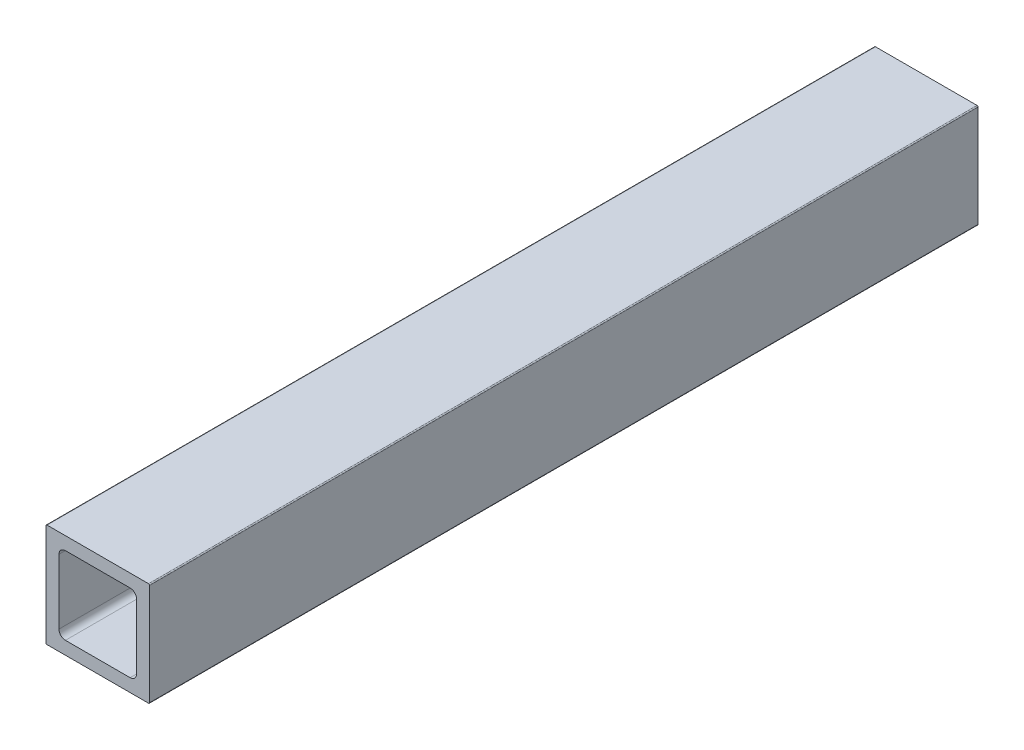
ISO-10303-21;
HEADER;
FILE_DESCRIPTION(('STEP AP214'),'2;1');
FILE_NAME('part.step','',(''),(''),'','','');
FILE_SCHEMA(('AUTOMOTIVE_DESIGN { 1 0 10303 214 1 1 1 1 }'));
ENDSEC;
DATA;
#1=APPLICATION_CONTEXT('core data for automotive mechanical design processes');
#2=APPLICATION_PROTOCOL_DEFINITION('international standard','automotive_design',2000,#1);
#3=PRODUCT_CONTEXT('',#1,'mechanical');
#4=PRODUCT('Part','Part','',(#3));
#5=PRODUCT_RELATED_PRODUCT_CATEGORY('part','',(#4));
#6=PRODUCT_DEFINITION_FORMATION('','',#4);
#7=PRODUCT_DEFINITION_CONTEXT('part definition',#1,'design');
#8=PRODUCT_DEFINITION('design','',#6,#7);
#9=PRODUCT_DEFINITION_SHAPE('','',#8);
#10=(LENGTH_UNIT() NAMED_UNIT(*) SI_UNIT(.MILLI.,.METRE.));
#11=(NAMED_UNIT(*) PLANE_ANGLE_UNIT() SI_UNIT($,.RADIAN.));
#12=(NAMED_UNIT(*) SI_UNIT($,.STERADIAN.) SOLID_ANGLE_UNIT());
#13=UNCERTAINTY_MEASURE_WITH_UNIT(LENGTH_MEASURE(1.E-05),#10,'distance_accuracy_value','');
#14=(GEOMETRIC_REPRESENTATION_CONTEXT(3) GLOBAL_UNCERTAINTY_ASSIGNED_CONTEXT((#13)) GLOBAL_UNIT_ASSIGNED_CONTEXT((#10,
#11,#12)) REPRESENTATION_CONTEXT('',''));
#15=CARTESIAN_POINT('',(0.,0.,0.));
#16=DIRECTION('',(0.,0.,1.));
#17=DIRECTION('',(1.,0.,0.));
#18=AXIS2_PLACEMENT_3D('',#15,#16,#17);
#19=CARTESIAN_POINT('',(3.175,4.7625,1828.8));
#20=DIRECTION('',(1.,0.,0.));
#21=DIRECTION('',(0.,1.,0.));
#22=AXIS2_PLACEMENT_3D('',#19,#20,#21);
#23=PLANE('',#22);
#24=DIRECTION('',(0.,-1.,0.));
#25=VECTOR('',#24,1.);
#26=CARTESIAN_POINT('',(3.175,4.7625,1625.6));
#27=LINE('',#26,#25);
#28=CARTESIAN_POINT('',(3.175,20.6375,1625.6));
#29=VERTEX_POINT('',#28);
#30=CARTESIAN_POINT('',(3.175,4.7625,1625.6));
#31=VERTEX_POINT('',#30);
#32=EDGE_CURVE('E58',#29,#31,#27,.T.);
#33=ORIENTED_EDGE('',*,*,#32,.F.);
#34=DIRECTION('',(0.,0.,-1.));
#35=VECTOR('',#34,1.);
#36=CARTESIAN_POINT('',(3.175,20.6375,1828.8));
#37=LINE('',#36,#35);
#38=CARTESIAN_POINT('',(3.175,20.6375,1828.8));
#39=VERTEX_POINT('',#38);
#40=EDGE_CURVE('E51',#39,#29,#37,.T.);
#41=ORIENTED_EDGE('',*,*,#40,.F.);
#42=DIRECTION('',(0.,-1.,0.));
#43=VECTOR('',#42,1.);
#44=CARTESIAN_POINT('',(3.175,4.7625,1828.8));
#45=LINE('',#44,#43);
#46=CARTESIAN_POINT('',(3.175,4.7625,1828.8));
#47=VERTEX_POINT('',#46);
#48=EDGE_CURVE('E218',#39,#47,#45,.T.);
#49=ORIENTED_EDGE('',*,*,#48,.T.);
#50=DIRECTION('',(0.,0.,-1.));
#51=VECTOR('',#50,1.);
#52=CARTESIAN_POINT('',(3.175,4.7625,1828.8));
#53=LINE('',#52,#51);
#54=EDGE_CURVE('E325',#47,#31,#53,.T.);
#55=ORIENTED_EDGE('',*,*,#54,.T.);
#56=EDGE_LOOP('',(#33,#41,#49,#55));
#57=FACE_BOUND('',#56,.T.);
#58=ADVANCED_FACE('F43',(#57),#23,.T.);
#59=CARTESIAN_POINT('',(4.7625,20.6375,1828.8));
#60=DIRECTION('',(0.,0.,-1.));
#61=DIRECTION('',(-1.,0.,0.));
#62=AXIS2_PLACEMENT_3D('',#59,#60,#61);
#63=CYLINDRICAL_SURFACE('',#62,1.5875);
#64=ORIENTED_EDGE('',*,*,#40,.T.);
#65=CARTESIAN_POINT('',(4.7625,20.6375,1625.6));
#66=DIRECTION('',(0.,0.,1.));
#67=DIRECTION('',(1.,0.,0.));
#68=AXIS2_PLACEMENT_3D('',#65,#66,#67);
#69=CIRCLE('',#68,1.5875);
#70=CARTESIAN_POINT('',(4.7625,22.225,1625.6));
#71=VERTEX_POINT('',#70);
#72=EDGE_CURVE('E304',#29,#71,#69,.F.);
#73=ORIENTED_EDGE('',*,*,#72,.T.);
#74=DIRECTION('',(0.,0.,-1.));
#75=VECTOR('',#74,1.);
#76=CARTESIAN_POINT('',(4.7625,22.225,1828.8));
#77=LINE('',#76,#75);
#78=CARTESIAN_POINT('',(4.7625,22.225,1828.8));
#79=VERTEX_POINT('',#78);
#80=EDGE_CURVE('E292',#79,#71,#77,.T.);
#81=ORIENTED_EDGE('',*,*,#80,.F.);
#82=CARTESIAN_POINT('',(4.7625,20.6375,1828.8));
#83=DIRECTION('',(0.,0.,1.));
#84=DIRECTION('',(-1.,0.,0.));
#85=AXIS2_PLACEMENT_3D('',#82,#83,#84);
#86=CIRCLE('',#85,1.5875);
#87=EDGE_CURVE('E223',#79,#39,#86,.T.);
#88=ORIENTED_EDGE('',*,*,#87,.T.);
#89=EDGE_LOOP('',(#64,#73,#81,#88));
#90=FACE_BOUND('',#89,.T.);
#91=ADVANCED_FACE('F302',(#90),#63,.F.);
#92=CARTESIAN_POINT('',(4.7625,22.225,1828.8));
#93=DIRECTION('',(0.,-1.,0.));
#94=DIRECTION('',(0.,0.,-1.));
#95=AXIS2_PLACEMENT_3D('',#92,#93,#94);
#96=PLANE('',#95);
#97=DIRECTION('',(-1.,0.,0.));
#98=VECTOR('',#97,1.);
#99=CARTESIAN_POINT('',(4.7625,22.225,1625.6));
#100=LINE('',#99,#98);
#101=CARTESIAN_POINT('',(20.6375,22.225,1625.6));
#102=VERTEX_POINT('',#101);
#103=EDGE_CURVE('E340',#102,#71,#100,.T.);
#104=ORIENTED_EDGE('',*,*,#103,.F.);
#105=DIRECTION('',(0.,0.,-1.));
#106=VECTOR('',#105,1.);
#107=CARTESIAN_POINT('',(20.6375,22.225,1828.8));
#108=LINE('',#107,#106);
#109=CARTESIAN_POINT('',(20.6375,22.225,1828.8));
#110=VERTEX_POINT('',#109);
#111=EDGE_CURVE('E238',#110,#102,#108,.T.);
#112=ORIENTED_EDGE('',*,*,#111,.F.);
#113=DIRECTION('',(-1.,0.,0.));
#114=VECTOR('',#113,1.);
#115=CARTESIAN_POINT('',(4.7625,22.225,1828.8));
#116=LINE('',#115,#114);
#117=EDGE_CURVE('E227',#110,#79,#116,.T.);
#118=ORIENTED_EDGE('',*,*,#117,.T.);
#119=ORIENTED_EDGE('',*,*,#80,.T.);
#120=EDGE_LOOP('',(#104,#112,#118,#119));
#121=FACE_BOUND('',#120,.T.);
#122=ADVANCED_FACE('F291',(#121),#96,.T.);
#123=CARTESIAN_POINT('',(20.6375,20.6375,1828.8));
#124=DIRECTION('',(0.,0.,-1.));
#125=DIRECTION('',(-1.,0.,0.));
#126=AXIS2_PLACEMENT_3D('',#123,#124,#125);
#127=CYLINDRICAL_SURFACE('',#126,1.5875);
#128=ORIENTED_EDGE('',*,*,#111,.T.);
#129=CARTESIAN_POINT('',(20.6375,20.6375,1625.6));
#130=DIRECTION('',(0.,0.,1.));
#131=DIRECTION('',(1.,0.,0.));
#132=AXIS2_PLACEMENT_3D('',#129,#130,#131);
#133=CIRCLE('',#132,1.5875);
#134=CARTESIAN_POINT('',(22.225,20.6375,1625.6));
#135=VERTEX_POINT('',#134);
#136=EDGE_CURVE('E342',#102,#135,#133,.F.);
#137=ORIENTED_EDGE('',*,*,#136,.T.);
#138=DIRECTION('',(0.,0.,-1.));
#139=VECTOR('',#138,1.);
#140=CARTESIAN_POINT('',(22.225,20.6375,1828.8));
#141=LINE('',#140,#139);
#142=CARTESIAN_POINT('',(22.225,20.6375,1828.8));
#143=VERTEX_POINT('',#142);
#144=EDGE_CURVE('E234',#143,#135,#141,.T.);
#145=ORIENTED_EDGE('',*,*,#144,.F.);
#146=CARTESIAN_POINT('',(20.6375,20.6375,1828.8));
#147=DIRECTION('',(0.,0.,1.));
#148=DIRECTION('',(-1.,0.,0.));
#149=AXIS2_PLACEMENT_3D('',#146,#147,#148);
#150=CIRCLE('',#149,1.5875);
#151=EDGE_CURVE('E213',#143,#110,#150,.T.);
#152=ORIENTED_EDGE('',*,*,#151,.T.);
#153=EDGE_LOOP('',(#128,#137,#145,#152));
#154=FACE_BOUND('',#153,.T.);
#155=ADVANCED_FACE('F500',(#154),#127,.F.);
#156=CARTESIAN_POINT('',(22.225,4.7625,1828.8));
#157=DIRECTION('',(-1.,0.,0.));
#158=DIRECTION('',(0.,0.,1.));
#159=AXIS2_PLACEMENT_3D('',#156,#157,#158);
#160=PLANE('',#159);
#161=DIRECTION('',(0.,1.,0.));
#162=VECTOR('',#161,1.);
#163=CARTESIAN_POINT('',(22.225,4.7625,1625.6));
#164=LINE('',#163,#162);
#165=CARTESIAN_POINT('',(22.225,4.7625,1625.6));
#166=VERTEX_POINT('',#165);
#167=EDGE_CURVE('E345',#166,#135,#164,.T.);
#168=ORIENTED_EDGE('',*,*,#167,.F.);
#169=DIRECTION('',(0.,0.,-1.));
#170=VECTOR('',#169,1.);
#171=CARTESIAN_POINT('',(22.225,4.7625,1828.8));
#172=LINE('',#171,#170);
#173=CARTESIAN_POINT('',(22.225,4.7625,1828.8));
#174=VERTEX_POINT('',#173);
#175=EDGE_CURVE('E239',#174,#166,#172,.T.);
#176=ORIENTED_EDGE('',*,*,#175,.F.);
#177=DIRECTION('',(0.,1.,0.));
#178=VECTOR('',#177,1.);
#179=CARTESIAN_POINT('',(22.225,4.7625,1828.8));
#180=LINE('',#179,#178);
#181=EDGE_CURVE('E209',#174,#143,#180,.T.);
#182=ORIENTED_EDGE('',*,*,#181,.T.);
#183=ORIENTED_EDGE('',*,*,#144,.T.);
#184=EDGE_LOOP('',(#168,#176,#182,#183));
#185=FACE_BOUND('',#184,.T.);
#186=ADVANCED_FACE('F396',(#185),#160,.T.);
#187=CARTESIAN_POINT('',(20.6375,4.7625,1828.8));
#188=DIRECTION('',(0.,0.,-1.));
#189=DIRECTION('',(-1.,0.,0.));
#190=AXIS2_PLACEMENT_3D('',#187,#188,#189);
#191=CYLINDRICAL_SURFACE('',#190,1.5875);
#192=ORIENTED_EDGE('',*,*,#175,.T.);
#193=CARTESIAN_POINT('',(20.6375,4.7625,1625.6));
#194=DIRECTION('',(0.,0.,1.));
#195=DIRECTION('',(1.,0.,0.));
#196=AXIS2_PLACEMENT_3D('',#193,#194,#195);
#197=CIRCLE('',#196,1.5875);
#198=CARTESIAN_POINT('',(20.6375,3.175,1625.6));
#199=VERTEX_POINT('',#198);
#200=EDGE_CURVE('E347',#166,#199,#197,.F.);
#201=ORIENTED_EDGE('',*,*,#200,.T.);
#202=DIRECTION('',(0.,0.,-1.));
#203=VECTOR('',#202,1.);
#204=CARTESIAN_POINT('',(20.6375,3.175,1828.8));
#205=LINE('',#204,#203);
#206=CARTESIAN_POINT('',(20.6375,3.175,1828.8));
#207=VERTEX_POINT('',#206);
#208=EDGE_CURVE('E265',#207,#199,#205,.T.);
#209=ORIENTED_EDGE('',*,*,#208,.F.);
#210=CARTESIAN_POINT('',(20.6375,4.7625,1828.8));
#211=DIRECTION('',(0.,0.,1.));
#212=DIRECTION('',(-1.,0.,0.));
#213=AXIS2_PLACEMENT_3D('',#210,#211,#212);
#214=CIRCLE('',#213,1.5875);
#215=EDGE_CURVE('E212',#207,#174,#214,.T.);
#216=ORIENTED_EDGE('',*,*,#215,.T.);
#217=EDGE_LOOP('',(#192,#201,#209,#216));
#218=FACE_BOUND('',#217,.T.);
#219=ADVANCED_FACE('F393',(#218),#191,.F.);
#220=CARTESIAN_POINT('',(4.7625,3.175,1828.8));
#221=DIRECTION('',(0.,1.,0.));
#222=DIRECTION('',(1.,0.,0.));
#223=AXIS2_PLACEMENT_3D('',#220,#221,#222);
#224=PLANE('',#223);
#225=DIRECTION('',(1.,0.,0.));
#226=VECTOR('',#225,1.);
#227=CARTESIAN_POINT('',(4.7625,3.175,1625.6));
#228=LINE('',#227,#226);
#229=CARTESIAN_POINT('',(4.7625,3.175,1625.6));
#230=VERTEX_POINT('',#229);
#231=EDGE_CURVE('E350',#230,#199,#228,.T.);
#232=ORIENTED_EDGE('',*,*,#231,.F.);
#233=DIRECTION('',(0.,0.,-1.));
#234=VECTOR('',#233,1.);
#235=CARTESIAN_POINT('',(4.7625,3.175,1828.8));
#236=LINE('',#235,#234);
#237=CARTESIAN_POINT('',(4.7625,3.175,1828.8));
#238=VERTEX_POINT('',#237);
#239=EDGE_CURVE('E269',#238,#230,#236,.T.);
#240=ORIENTED_EDGE('',*,*,#239,.F.);
#241=DIRECTION('',(1.,0.,0.));
#242=VECTOR('',#241,1.);
#243=CARTESIAN_POINT('',(4.7625,3.175,1828.8));
#244=LINE('',#243,#242);
#245=EDGE_CURVE('E255',#238,#207,#244,.T.);
#246=ORIENTED_EDGE('',*,*,#245,.T.);
#247=ORIENTED_EDGE('',*,*,#208,.T.);
#248=EDGE_LOOP('',(#232,#240,#246,#247));
#249=FACE_BOUND('',#248,.T.);
#250=ADVANCED_FACE('F395',(#249),#224,.T.);
#251=CARTESIAN_POINT('',(4.7625,4.7625,1828.8));
#252=DIRECTION('',(0.,0.,-1.));
#253=DIRECTION('',(-1.,0.,0.));
#254=AXIS2_PLACEMENT_3D('',#251,#252,#253);
#255=CYLINDRICAL_SURFACE('',#254,1.5875);
#256=ORIENTED_EDGE('',*,*,#239,.T.);
#257=CARTESIAN_POINT('',(4.7625,4.7625,1625.6));
#258=DIRECTION('',(0.,0.,1.));
#259=DIRECTION('',(1.,0.,0.));
#260=AXIS2_PLACEMENT_3D('',#257,#258,#259);
#261=CIRCLE('',#260,1.5875);
#262=EDGE_CURVE('E352',#230,#31,#261,.F.);
#263=ORIENTED_EDGE('',*,*,#262,.T.);
#264=ORIENTED_EDGE('',*,*,#54,.F.);
#265=CARTESIAN_POINT('',(4.7625,4.7625,1828.8));
#266=DIRECTION('',(0.,0.,1.));
#267=DIRECTION('',(1.,0.,0.));
#268=AXIS2_PLACEMENT_3D('',#265,#266,#267);
#269=CIRCLE('',#268,1.5875);
#270=EDGE_CURVE('E214',#47,#238,#269,.T.);
#271=ORIENTED_EDGE('',*,*,#270,.T.);
#272=EDGE_LOOP('',(#256,#263,#264,#271));
#273=FACE_BOUND('',#272,.T.);
#274=ADVANCED_FACE('F431',(#273),#255,.F.);
#275=CARTESIAN_POINT('',(0.,0.254,1828.8));
#276=DIRECTION('',(1.,0.,0.));
#277=DIRECTION('',(0.,1.,0.));
#278=AXIS2_PLACEMENT_3D('',#275,#276,#277);
#279=PLANE('',#278);
#280=DIRECTION('',(0.,0.,-1.));
#281=VECTOR('',#280,1.);
#282=CARTESIAN_POINT('',(0.,25.146,1828.8));
#283=LINE('',#282,#281);
#284=CARTESIAN_POINT('',(0.,25.146,1828.8));
#285=VERTEX_POINT('',#284);
#286=CARTESIAN_POINT('',(0.,25.146,1625.6));
#287=VERTEX_POINT('',#286);
#288=EDGE_CURVE('E264',#285,#287,#283,.T.);
#289=ORIENTED_EDGE('',*,*,#288,.T.);
#290=DIRECTION('',(0.,-1.,0.));
#291=VECTOR('',#290,1.);
#292=CARTESIAN_POINT('',(0.,0.254,1625.6));
#293=LINE('',#292,#291);
#294=CARTESIAN_POINT('',(0.,0.254,1625.6));
#295=VERTEX_POINT('',#294);
#296=EDGE_CURVE('E185',#287,#295,#293,.T.);
#297=ORIENTED_EDGE('',*,*,#296,.T.);
#298=DIRECTION('',(0.,0.,-1.));
#299=VECTOR('',#298,1.);
#300=CARTESIAN_POINT('',(0.,0.254,1828.8));
#301=LINE('',#300,#299);
#302=CARTESIAN_POINT('',(0.,0.254,1828.8));
#303=VERTEX_POINT('',#302);
#304=EDGE_CURVE('E194',#303,#295,#301,.T.);
#305=ORIENTED_EDGE('',*,*,#304,.F.);
#306=DIRECTION('',(0.,-1.,0.));
#307=VECTOR('',#306,1.);
#308=CARTESIAN_POINT('',(0.,0.254,1828.8));
#309=LINE('',#308,#307);
#310=EDGE_CURVE('E219',#285,#303,#309,.T.);
#311=ORIENTED_EDGE('',*,*,#310,.F.);
#312=EDGE_LOOP('',(#289,#297,#305,#311));
#313=FACE_BOUND('',#312,.T.);
#314=ADVANCED_FACE('F425',(#313),#279,.F.);
#315=CARTESIAN_POINT('',(0.254,25.146,1828.8));
#316=DIRECTION('',(0.,0.,-1.));
#317=DIRECTION('',(-1.,0.,0.));
#318=AXIS2_PLACEMENT_3D('',#315,#316,#317);
#319=CYLINDRICAL_SURFACE('',#318,0.254);
#320=CARTESIAN_POINT('',(0.254,25.146,1625.6));
#321=DIRECTION('',(0.,0.,1.));
#322=DIRECTION('',(1.,0.,0.));
#323=AXIS2_PLACEMENT_3D('',#320,#321,#322);
#324=CIRCLE('',#323,0.254);
#325=CARTESIAN_POINT('',(0.254000000000004,25.4,1625.6));
#326=VERTEX_POINT('',#325);
#327=EDGE_CURVE('E176',#287,#326,#324,.F.);
#328=ORIENTED_EDGE('',*,*,#327,.F.);
#329=ORIENTED_EDGE('',*,*,#288,.F.);
#330=CARTESIAN_POINT('',(0.254,25.146,1828.8));
#331=DIRECTION('',(0.,0.,1.));
#332=DIRECTION('',(-1.,0.,0.));
#333=AXIS2_PLACEMENT_3D('',#330,#331,#332);
#334=CIRCLE('',#333,0.254);
#335=CARTESIAN_POINT('',(0.254,25.4,1828.8));
#336=VERTEX_POINT('',#335);
#337=EDGE_CURVE('E240',#336,#285,#334,.T.);
#338=ORIENTED_EDGE('',*,*,#337,.F.);
#339=DIRECTION('',(0.,0.,-1.));
#340=VECTOR('',#339,1.);
#341=CARTESIAN_POINT('',(0.254,25.4,1828.8));
#342=LINE('',#341,#340);
#343=EDGE_CURVE('E260',#336,#326,#342,.T.);
#344=ORIENTED_EDGE('',*,*,#343,.T.);
#345=EDGE_LOOP('',(#328,#329,#338,#344));
#346=FACE_BOUND('',#345,.T.);
#347=ADVANCED_FACE('F430',(#346),#319,.T.);
#348=CARTESIAN_POINT('',(0.254,25.4,1828.8));
#349=DIRECTION('',(0.,-1.,0.));
#350=DIRECTION('',(0.,0.,-1.));
#351=AXIS2_PLACEMENT_3D('',#348,#349,#350);
#352=PLANE('',#351);
#353=DIRECTION('',(0.,0.,-1.));
#354=VECTOR('',#353,1.);
#355=CARTESIAN_POINT('',(25.146,25.4,1828.8));
#356=LINE('',#355,#354);
#357=CARTESIAN_POINT('',(25.146,25.4,1828.8));
#358=VERTEX_POINT('',#357);
#359=CARTESIAN_POINT('',(25.146,25.4,1625.6));
#360=VERTEX_POINT('',#359);
#361=EDGE_CURVE('E256',#358,#360,#356,.T.);
#362=ORIENTED_EDGE('',*,*,#361,.T.);
#363=DIRECTION('',(1.,0.,0.));
#364=VECTOR('',#363,1.);
#365=CARTESIAN_POINT('',(-135.222379220066,25.4,1625.6));
#366=LINE('',#365,#364);
#367=EDGE_CURVE('E186',#326,#360,#366,.T.);
#368=ORIENTED_EDGE('',*,*,#367,.F.);
#369=ORIENTED_EDGE('',*,*,#343,.F.);
#370=DIRECTION('',(-1.,0.,0.));
#371=VECTOR('',#370,1.);
#372=CARTESIAN_POINT('',(0.254,25.4,1828.8));
#373=LINE('',#372,#371);
#374=EDGE_CURVE('E232',#358,#336,#373,.T.);
#375=ORIENTED_EDGE('',*,*,#374,.F.);
#376=EDGE_LOOP('',(#362,#368,#369,#375));
#377=FACE_BOUND('',#376,.T.);
#378=ADVANCED_FACE('F367',(#377),#352,.F.);
#379=CARTESIAN_POINT('',(25.146,25.146,1828.8));
#380=DIRECTION('',(0.,0.,-1.));
#381=DIRECTION('',(-1.,0.,0.));
#382=AXIS2_PLACEMENT_3D('',#379,#380,#381);
#383=CYLINDRICAL_SURFACE('',#382,0.254);
#384=CARTESIAN_POINT('',(25.146,25.146,1625.6));
#385=DIRECTION('',(0.,0.,1.));
#386=DIRECTION('',(1.,0.,0.));
#387=AXIS2_PLACEMENT_3D('',#384,#385,#386);
#388=CIRCLE('',#387,0.254);
#389=CARTESIAN_POINT('',(25.4,25.146,1625.6));
#390=VERTEX_POINT('',#389);
#391=EDGE_CURVE('E354',#360,#390,#388,.F.);
#392=ORIENTED_EDGE('',*,*,#391,.F.);
#393=ORIENTED_EDGE('',*,*,#361,.F.);
#394=CARTESIAN_POINT('',(25.146,25.146,1828.8));
#395=DIRECTION('',(0.,0.,1.));
#396=DIRECTION('',(-1.,0.,0.));
#397=AXIS2_PLACEMENT_3D('',#394,#395,#396);
#398=CIRCLE('',#397,0.254);
#399=CARTESIAN_POINT('',(25.4,25.146,1828.8));
#400=VERTEX_POINT('',#399);
#401=EDGE_CURVE('E228',#400,#358,#398,.T.);
#402=ORIENTED_EDGE('',*,*,#401,.F.);
#403=DIRECTION('',(0.,0.,-1.));
#404=VECTOR('',#403,1.);
#405=CARTESIAN_POINT('',(25.4,25.146,1828.8));
#406=LINE('',#405,#404);
#407=EDGE_CURVE('E201',#400,#390,#406,.T.);
#408=ORIENTED_EDGE('',*,*,#407,.T.);
#409=EDGE_LOOP('',(#392,#393,#402,#408));
#410=FACE_BOUND('',#409,.T.);
#411=ADVANCED_FACE('F45',(#410),#383,.T.);
#412=CARTESIAN_POINT('',(25.4,0.254,1828.8));
#413=DIRECTION('',(-1.,0.,0.));
#414=DIRECTION('',(0.,0.,1.));
#415=AXIS2_PLACEMENT_3D('',#412,#413,#414);
#416=PLANE('',#415);
#417=DIRECTION('',(0.,0.,-1.));
#418=VECTOR('',#417,1.);
#419=CARTESIAN_POINT('',(25.4,0.254,1828.8));
#420=LINE('',#419,#418);
#421=CARTESIAN_POINT('',(25.4,0.254,1828.8));
#422=VERTEX_POINT('',#421);
#423=CARTESIAN_POINT('',(25.4,0.254,1625.6));
#424=VERTEX_POINT('',#423);
#425=EDGE_CURVE('E193',#422,#424,#420,.T.);
#426=ORIENTED_EDGE('',*,*,#425,.T.);
#427=DIRECTION('',(0.,1.,0.));
#428=VECTOR('',#427,1.);
#429=CARTESIAN_POINT('',(25.4,0.254,1625.6));
#430=LINE('',#429,#428);
#431=EDGE_CURVE('E172',#424,#390,#430,.T.);
#432=ORIENTED_EDGE('',*,*,#431,.T.);
#433=ORIENTED_EDGE('',*,*,#407,.F.);
#434=DIRECTION('',(0.,1.,0.));
#435=VECTOR('',#434,1.);
#436=CARTESIAN_POINT('',(25.4,0.254,1828.8));
#437=LINE('',#436,#435);
#438=EDGE_CURVE('E233',#422,#400,#437,.T.);
#439=ORIENTED_EDGE('',*,*,#438,.F.);
#440=EDGE_LOOP('',(#426,#432,#433,#439));
#441=FACE_BOUND('',#440,.T.);
#442=ADVANCED_FACE('F371',(#441),#416,.F.);
#443=CARTESIAN_POINT('',(25.146,0.254,1828.8));
#444=DIRECTION('',(0.,0.,-1.));
#445=DIRECTION('',(-1.,0.,0.));
#446=AXIS2_PLACEMENT_3D('',#443,#444,#445);
#447=CYLINDRICAL_SURFACE('',#446,0.254);
#448=CARTESIAN_POINT('',(25.146,0.254,1625.6));
#449=DIRECTION('',(0.,0.,1.));
#450=DIRECTION('',(1.,0.,0.));
#451=AXIS2_PLACEMENT_3D('',#448,#449,#450);
#452=CIRCLE('',#451,0.254);
#453=CARTESIAN_POINT('',(25.146,0.,1625.6));
#454=VERTEX_POINT('',#453);
#455=EDGE_CURVE('E169',#424,#454,#452,.F.);
#456=ORIENTED_EDGE('',*,*,#455,.F.);
#457=ORIENTED_EDGE('',*,*,#425,.F.);
#458=CARTESIAN_POINT('',(25.146,0.254,1828.8));
#459=DIRECTION('',(0.,0.,1.));
#460=DIRECTION('',(1.,0.,0.));
#461=AXIS2_PLACEMENT_3D('',#458,#459,#460);
#462=CIRCLE('',#461,0.254);
#463=CARTESIAN_POINT('',(25.146,0.,1828.8));
#464=VERTEX_POINT('',#463);
#465=EDGE_CURVE('E190',#464,#422,#462,.T.);
#466=ORIENTED_EDGE('',*,*,#465,.F.);
#467=DIRECTION('',(0.,0.,-1.));
#468=VECTOR('',#467,1.);
#469=CARTESIAN_POINT('',(25.146,0.,1828.8));
#470=LINE('',#469,#468);
#471=EDGE_CURVE('E182',#464,#454,#470,.T.);
#472=ORIENTED_EDGE('',*,*,#471,.T.);
#473=EDGE_LOOP('',(#456,#457,#466,#472));
#474=FACE_BOUND('',#473,.T.);
#475=ADVANCED_FACE('F188',(#474),#447,.T.);
#476=CARTESIAN_POINT('',(0.254,0.,1828.8));
#477=DIRECTION('',(0.,1.,0.));
#478=DIRECTION('',(1.,0.,0.));
#479=AXIS2_PLACEMENT_3D('',#476,#477,#478);
#480=PLANE('',#479);
#481=DIRECTION('',(0.,0.,-1.));
#482=VECTOR('',#481,1.);
#483=CARTESIAN_POINT('',(0.254,0.,1828.8));
#484=LINE('',#483,#482);
#485=CARTESIAN_POINT('',(0.254,0.,1828.8));
#486=VERTEX_POINT('',#485);
#487=CARTESIAN_POINT('',(0.254,0.,1625.6));
#488=VERTEX_POINT('',#487);
#489=EDGE_CURVE('E184',#486,#488,#484,.T.);
#490=ORIENTED_EDGE('',*,*,#489,.T.);
#491=DIRECTION('',(-1.,0.,0.));
#492=VECTOR('',#491,1.);
#493=CARTESIAN_POINT('',(-135.222379220066,0.,1625.6));
#494=LINE('',#493,#492);
#495=EDGE_CURVE('E65',#454,#488,#494,.T.);
#496=ORIENTED_EDGE('',*,*,#495,.F.);
#497=ORIENTED_EDGE('',*,*,#471,.F.);
#498=DIRECTION('',(1.,0.,0.));
#499=VECTOR('',#498,1.);
#500=CARTESIAN_POINT('',(0.254,0.,1828.8));
#501=LINE('',#500,#499);
#502=EDGE_CURVE('E249',#486,#464,#501,.T.);
#503=ORIENTED_EDGE('',*,*,#502,.F.);
#504=EDGE_LOOP('',(#490,#496,#497,#503));
#505=FACE_BOUND('',#504,.T.);
#506=ADVANCED_FACE('F180',(#505),#480,.F.);
#507=CARTESIAN_POINT('',(0.254,0.254,1828.8));
#508=DIRECTION('',(0.,0.,-1.));
#509=DIRECTION('',(-1.,0.,0.));
#510=AXIS2_PLACEMENT_3D('',#507,#508,#509);
#511=CYLINDRICAL_SURFACE('',#510,0.254);
#512=CARTESIAN_POINT('',(0.254,0.254,1625.6));
#513=DIRECTION('',(0.,0.,1.));
#514=DIRECTION('',(1.,0.,0.));
#515=AXIS2_PLACEMENT_3D('',#512,#513,#514);
#516=CIRCLE('',#515,0.254);
#517=EDGE_CURVE('E11',#488,#295,#516,.F.);
#518=ORIENTED_EDGE('',*,*,#517,.F.);
#519=ORIENTED_EDGE('',*,*,#489,.F.);
#520=CARTESIAN_POINT('',(0.254,0.254,1828.8));
#521=DIRECTION('',(0.,0.,1.));
#522=DIRECTION('',(-1.,0.,0.));
#523=AXIS2_PLACEMENT_3D('',#520,#521,#522);
#524=CIRCLE('',#523,0.254);
#525=EDGE_CURVE('E252',#303,#486,#524,.T.);
#526=ORIENTED_EDGE('',*,*,#525,.F.);
#527=ORIENTED_EDGE('',*,*,#304,.T.);
#528=EDGE_LOOP('',(#518,#519,#526,#527));
#529=FACE_BOUND('',#528,.T.);
#530=ADVANCED_FACE('F389',(#529),#511,.T.);
#531=CARTESIAN_POINT('',(0.254,0.254,1828.8));
#532=DIRECTION('',(0.,0.,-1.));
#533=DIRECTION('',(0.,-1.,0.));
#534=AXIS2_PLACEMENT_3D('',#531,#532,#533);
#535=PLANE('',#534);
#536=ORIENTED_EDGE('',*,*,#270,.F.);
#537=ORIENTED_EDGE('',*,*,#48,.F.);
#538=ORIENTED_EDGE('',*,*,#87,.F.);
#539=ORIENTED_EDGE('',*,*,#117,.F.);
#540=ORIENTED_EDGE('',*,*,#151,.F.);
#541=ORIENTED_EDGE('',*,*,#181,.F.);
#542=ORIENTED_EDGE('',*,*,#215,.F.);
#543=ORIENTED_EDGE('',*,*,#245,.F.);
#544=EDGE_LOOP('',(#536,#537,#538,#539,#540,#541,#542,#543));
#545=FACE_BOUND('',#544,.T.);
#546=ORIENTED_EDGE('',*,*,#525,.T.);
#547=ORIENTED_EDGE('',*,*,#502,.T.);
#548=ORIENTED_EDGE('',*,*,#465,.T.);
#549=ORIENTED_EDGE('',*,*,#438,.T.);
#550=ORIENTED_EDGE('',*,*,#401,.T.);
#551=ORIENTED_EDGE('',*,*,#374,.T.);
#552=ORIENTED_EDGE('',*,*,#337,.T.);
#553=ORIENTED_EDGE('',*,*,#310,.T.);
#554=EDGE_LOOP('',(#546,#547,#548,#549,#550,#551,#552,#553));
#555=FACE_BOUND('',#554,.T.);
#556=ADVANCED_FACE('F298',(#545,#555),#535,.F.);
#557=CARTESIAN_POINT('',(-135.222379220066,-1647.92583637368,1625.6));
#558=DIRECTION('',(0.,0.,1.));
#559=DIRECTION('',(1.,0.,0.));
#560=AXIS2_PLACEMENT_3D('',#557,#558,#559);
#561=PLANE('',#560);
#562=ORIENTED_EDGE('',*,*,#32,.T.);
#563=ORIENTED_EDGE('',*,*,#262,.F.);
#564=ORIENTED_EDGE('',*,*,#231,.T.);
#565=ORIENTED_EDGE('',*,*,#200,.F.);
#566=ORIENTED_EDGE('',*,*,#167,.T.);
#567=ORIENTED_EDGE('',*,*,#136,.F.);
#568=ORIENTED_EDGE('',*,*,#103,.T.);
#569=ORIENTED_EDGE('',*,*,#72,.F.);
#570=EDGE_LOOP('',(#562,#563,#564,#565,#566,#567,#568,#569));
#571=FACE_BOUND('',#570,.T.);
#572=ORIENTED_EDGE('',*,*,#391,.T.);
#573=ORIENTED_EDGE('',*,*,#431,.F.);
#574=ORIENTED_EDGE('',*,*,#455,.T.);
#575=ORIENTED_EDGE('',*,*,#495,.T.);
#576=ORIENTED_EDGE('',*,*,#517,.T.);
#577=ORIENTED_EDGE('',*,*,#296,.F.);
#578=ORIENTED_EDGE('',*,*,#327,.T.);
#579=ORIENTED_EDGE('',*,*,#367,.T.);
#580=EDGE_LOOP('',(#572,#573,#574,#575,#576,#577,#578,#579));
#581=FACE_BOUND('',#580,.T.);
#582=ADVANCED_FACE('F170',(#571,#581),#561,.F.);
#583=CLOSED_SHELL('',(#58,#91,#122,#155,#186,#219,#250,#274,#314,#347,#378,#411,#442,#475,#506,
#530,#556,#582));
#584=MANIFOLD_SOLID_BREP('B2',#583);
#585=ADVANCED_BREP_SHAPE_REPRESENTATION('',(#18,#584),#14);
#586=SHAPE_DEFINITION_REPRESENTATION(#9,#585);
ENDSEC;
END-ISO-10303-21;
